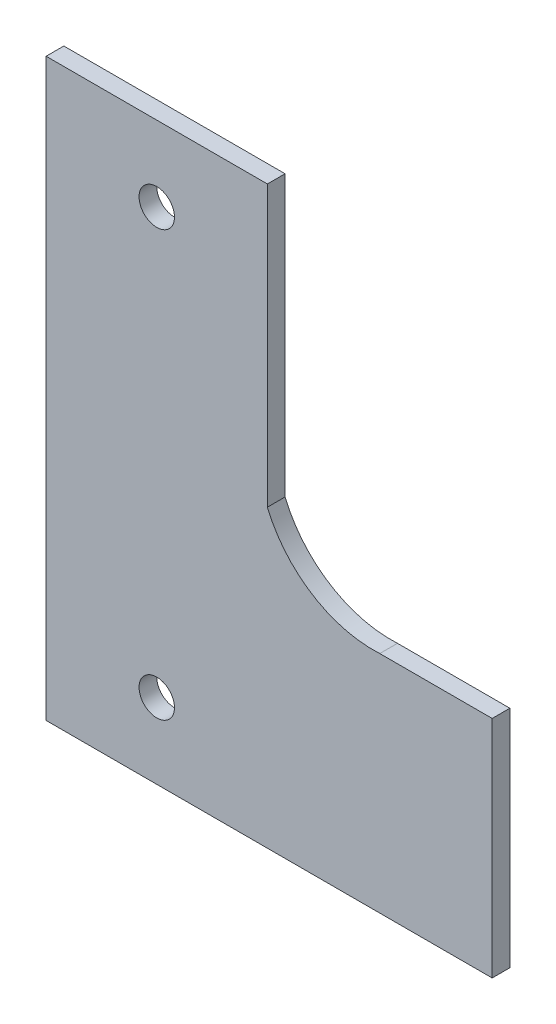
ISO-10303-21;
HEADER;
FILE_DESCRIPTION(('STEP AP214'),'2;1');
FILE_NAME('part.step','',(''),(''),'','','');
FILE_SCHEMA(('AUTOMOTIVE_DESIGN { 1 0 10303 214 1 1 1 1 }'));
ENDSEC;
DATA;
#1=APPLICATION_CONTEXT('core data for automotive mechanical design processes');
#2=APPLICATION_PROTOCOL_DEFINITION('international standard','automotive_design',2000,#1);
#3=PRODUCT_CONTEXT('',#1,'mechanical');
#4=PRODUCT('Part','Part','',(#3));
#5=PRODUCT_RELATED_PRODUCT_CATEGORY('part','',(#4));
#6=PRODUCT_DEFINITION_FORMATION('','',#4);
#7=PRODUCT_DEFINITION_CONTEXT('part definition',#1,'design');
#8=PRODUCT_DEFINITION('design','',#6,#7);
#9=PRODUCT_DEFINITION_SHAPE('','',#8);
#10=(LENGTH_UNIT() NAMED_UNIT(*) SI_UNIT(.MILLI.,.METRE.));
#11=(NAMED_UNIT(*) PLANE_ANGLE_UNIT() SI_UNIT($,.RADIAN.));
#12=(NAMED_UNIT(*) SI_UNIT($,.STERADIAN.) SOLID_ANGLE_UNIT());
#13=UNCERTAINTY_MEASURE_WITH_UNIT(LENGTH_MEASURE(1.E-05),#10,'distance_accuracy_value','');
#14=(GEOMETRIC_REPRESENTATION_CONTEXT(3) GLOBAL_UNCERTAINTY_ASSIGNED_CONTEXT((#13)) GLOBAL_UNIT_ASSIGNED_CONTEXT((#10,
#11,#12)) REPRESENTATION_CONTEXT('',''));
#15=CARTESIAN_POINT('',(0.,0.,0.));
#16=DIRECTION('',(0.,0.,1.));
#17=DIRECTION('',(1.,0.,0.));
#18=AXIS2_PLACEMENT_3D('',#15,#16,#17);
#19=CARTESIAN_POINT('',(0.,7.24006270311024,2.));
#20=DIRECTION('',(0.,1.,0.));
#21=DIRECTION('',(-1.,0.,0.));
#22=AXIS2_PLACEMENT_3D('',#19,#20,#21);
#23=PLANE('',#22);
#24=DIRECTION('',(1.,0.,0.));
#25=VECTOR('',#24,1.);
#26=CARTESIAN_POINT('',(0.,7.24006270311024,0.));
#27=LINE('',#26,#25);
#28=CARTESIAN_POINT('',(22.4630357452038,7.24006270311024,0.));
#29=VERTEX_POINT('',#28);
#30=CARTESIAN_POINT('',(35.1630357452038,7.24006270311024,0.));
#31=VERTEX_POINT('',#30);
#32=EDGE_CURVE('E130',#29,#31,#27,.T.);
#33=ORIENTED_EDGE('',*,*,#32,.F.);
#34=DIRECTION('',(0.,0.,-1.));
#35=VECTOR('',#34,1.);
#36=CARTESIAN_POINT('',(22.4630357452038,7.24006270311024,2.));
#37=LINE('',#36,#35);
#38=CARTESIAN_POINT('',(22.4630357452038,7.24006270311024,2.));
#39=VERTEX_POINT('',#38);
#40=EDGE_CURVE('E11',#39,#29,#37,.T.);
#41=ORIENTED_EDGE('',*,*,#40,.F.);
#42=DIRECTION('',(1.,0.,0.));
#43=VECTOR('',#42,1.);
#44=CARTESIAN_POINT('',(0.,7.24006270311024,2.));
#45=LINE('',#44,#43);
#46=CARTESIAN_POINT('',(35.1630357452038,7.24006270311024,2.));
#47=VERTEX_POINT('',#46);
#48=EDGE_CURVE('E153',#39,#47,#45,.T.);
#49=ORIENTED_EDGE('',*,*,#48,.T.);
#50=DIRECTION('',(0.,0.,-1.));
#51=VECTOR('',#50,1.);
#52=CARTESIAN_POINT('',(35.1630357452038,7.24006270311024,2.));
#53=LINE('',#52,#51);
#54=EDGE_CURVE('E51',#47,#31,#53,.T.);
#55=ORIENTED_EDGE('',*,*,#54,.T.);
#56=EDGE_LOOP('',(#33,#41,#49,#55));
#57=FACE_BOUND('',#56,.T.);
#58=ADVANCED_FACE('F35',(#57),#23,.T.);
#59=CARTESIAN_POINT('',(21.724237457013,20.1663444718695,2.));
#60=DIRECTION('',(0.,0.,-1.));
#61=DIRECTION('',(-1.,0.,0.));
#62=AXIS2_PLACEMENT_3D('',#59,#60,#61);
#63=CYLINDRICAL_SURFACE('',#62,12.9473774671164);
#64=CARTESIAN_POINT('',(21.724237457013,20.1663444718695,0.));
#65=DIRECTION('',(0.,0.,1.));
#66=DIRECTION('',(1.,0.,0.));
#67=AXIS2_PLACEMENT_3D('',#64,#65,#66);
#68=CIRCLE('',#67,12.9473774671164);
#69=CARTESIAN_POINT('',(9.76303574520384,15.2101123460097,0.));
#70=VERTEX_POINT('',#69);
#71=EDGE_CURVE('E132',#29,#70,#68,.F.);
#72=ORIENTED_EDGE('',*,*,#71,.T.);
#73=DIRECTION('',(0.,0.,-1.));
#74=VECTOR('',#73,1.);
#75=CARTESIAN_POINT('',(9.76303574520384,15.2101123460097,2.));
#76=LINE('',#75,#74);
#77=CARTESIAN_POINT('',(9.76303574520384,15.2101123460097,2.));
#78=VERTEX_POINT('',#77);
#79=EDGE_CURVE('E43',#78,#70,#76,.T.);
#80=ORIENTED_EDGE('',*,*,#79,.F.);
#81=CARTESIAN_POINT('',(21.724237457013,20.1663444718695,2.));
#82=DIRECTION('',(0.,0.,1.));
#83=DIRECTION('',(1.,0.,0.));
#84=AXIS2_PLACEMENT_3D('',#81,#82,#83);
#85=CIRCLE('',#84,12.9473774671164);
#86=EDGE_CURVE('E173',#39,#78,#85,.F.);
#87=ORIENTED_EDGE('',*,*,#86,.F.);
#88=ORIENTED_EDGE('',*,*,#40,.T.);
#89=EDGE_LOOP('',(#72,#80,#87,#88));
#90=FACE_BOUND('',#89,.T.);
#91=ADVANCED_FACE('F166',(#90),#63,.F.);
#92=CARTESIAN_POINT('',(9.76303574520384,0.,2.));
#93=DIRECTION('',(1.,0.,0.));
#94=DIRECTION('',(0.,1.,0.));
#95=AXIS2_PLACEMENT_3D('',#92,#93,#94);
#96=PLANE('',#95);
#97=DIRECTION('',(0.,-1.,0.));
#98=VECTOR('',#97,1.);
#99=CARTESIAN_POINT('',(9.76303574520384,0.,0.));
#100=LINE('',#99,#98);
#101=CARTESIAN_POINT('',(9.76303574520383,46.8400627031102,0.));
#102=VERTEX_POINT('',#101);
#103=EDGE_CURVE('E135',#102,#70,#100,.T.);
#104=ORIENTED_EDGE('',*,*,#103,.F.);
#105=DIRECTION('',(0.,0.,-1.));
#106=VECTOR('',#105,1.);
#107=CARTESIAN_POINT('',(9.76303574520383,46.8400627031102,2.));
#108=LINE('',#107,#106);
#109=CARTESIAN_POINT('',(9.76303574520383,46.8400627031102,2.));
#110=VERTEX_POINT('',#109);
#111=EDGE_CURVE('E157',#110,#102,#108,.T.);
#112=ORIENTED_EDGE('',*,*,#111,.F.);
#113=DIRECTION('',(0.,-1.,0.));
#114=VECTOR('',#113,1.);
#115=CARTESIAN_POINT('',(9.76303574520384,0.,2.));
#116=LINE('',#115,#114);
#117=EDGE_CURVE('E163',#110,#78,#116,.T.);
#118=ORIENTED_EDGE('',*,*,#117,.T.);
#119=ORIENTED_EDGE('',*,*,#79,.T.);
#120=EDGE_LOOP('',(#104,#112,#118,#119));
#121=FACE_BOUND('',#120,.T.);
#122=ADVANCED_FACE('F162',(#121),#96,.T.);
#123=CARTESIAN_POINT('',(0.,46.8400627031102,2.));
#124=DIRECTION('',(0.,1.,0.));
#125=DIRECTION('',(0.,0.,1.));
#126=AXIS2_PLACEMENT_3D('',#123,#124,#125);
#127=PLANE('',#126);
#128=DIRECTION('',(1.,0.,0.));
#129=VECTOR('',#128,1.);
#130=CARTESIAN_POINT('',(0.,46.8400627031102,0.));
#131=LINE('',#130,#129);
#132=CARTESIAN_POINT('',(-15.2369642547962,46.8400627031102,0.));
#133=VERTEX_POINT('',#132);
#134=EDGE_CURVE('E138',#133,#102,#131,.T.);
#135=ORIENTED_EDGE('',*,*,#134,.F.);
#136=DIRECTION('',(0.,0.,-1.));
#137=VECTOR('',#136,1.);
#138=CARTESIAN_POINT('',(-15.2369642547962,46.8400627031102,2.));
#139=LINE('',#138,#137);
#140=CARTESIAN_POINT('',(-15.2369642547962,46.8400627031102,2.));
#141=VERTEX_POINT('',#140);
#142=EDGE_CURVE('E104',#141,#133,#139,.T.);
#143=ORIENTED_EDGE('',*,*,#142,.F.);
#144=DIRECTION('',(1.,0.,0.));
#145=VECTOR('',#144,1.);
#146=CARTESIAN_POINT('',(0.,46.8400627031102,2.));
#147=LINE('',#146,#145);
#148=EDGE_CURVE('E116',#141,#110,#147,.T.);
#149=ORIENTED_EDGE('',*,*,#148,.T.);
#150=ORIENTED_EDGE('',*,*,#111,.T.);
#151=EDGE_LOOP('',(#135,#143,#149,#150));
#152=FACE_BOUND('',#151,.T.);
#153=ADVANCED_FACE('F172',(#152),#127,.T.);
#154=CARTESIAN_POINT('',(-15.2369642547962,0.,2.));
#155=DIRECTION('',(-1.,0.,0.));
#156=DIRECTION('',(0.,0.,1.));
#157=AXIS2_PLACEMENT_3D('',#154,#155,#156);
#158=PLANE('',#157);
#159=DIRECTION('',(0.,1.,0.));
#160=VECTOR('',#159,1.);
#161=CARTESIAN_POINT('',(-15.2369642547962,0.,0.));
#162=LINE('',#161,#160);
#163=CARTESIAN_POINT('',(-15.2369642547962,-18.1599372968898,0.));
#164=VERTEX_POINT('',#163);
#165=EDGE_CURVE('E100',#164,#133,#162,.T.);
#166=ORIENTED_EDGE('',*,*,#165,.F.);
#167=DIRECTION('',(0.,0.,-1.));
#168=VECTOR('',#167,1.);
#169=CARTESIAN_POINT('',(-15.2369642547962,-18.1599372968898,2.));
#170=LINE('',#169,#168);
#171=CARTESIAN_POINT('',(-15.2369642547962,-18.1599372968898,2.));
#172=VERTEX_POINT('',#171);
#173=EDGE_CURVE('E95',#172,#164,#170,.T.);
#174=ORIENTED_EDGE('',*,*,#173,.F.);
#175=DIRECTION('',(0.,1.,0.));
#176=VECTOR('',#175,1.);
#177=CARTESIAN_POINT('',(-15.2369642547962,0.,2.));
#178=LINE('',#177,#176);
#179=EDGE_CURVE('E98',#172,#141,#178,.T.);
#180=ORIENTED_EDGE('',*,*,#179,.T.);
#181=ORIENTED_EDGE('',*,*,#142,.T.);
#182=EDGE_LOOP('',(#166,#174,#180,#181));
#183=FACE_BOUND('',#182,.T.);
#184=ADVANCED_FACE('F97',(#183),#158,.T.);
#185=CARTESIAN_POINT('',(0.,-18.1599372968898,2.));
#186=DIRECTION('',(0.,-1.,0.));
#187=DIRECTION('',(1.,0.,0.));
#188=AXIS2_PLACEMENT_3D('',#185,#186,#187);
#189=PLANE('',#188);
#190=DIRECTION('',(-1.,0.,0.));
#191=VECTOR('',#190,1.);
#192=CARTESIAN_POINT('',(0.,-18.1599372968898,0.));
#193=LINE('',#192,#191);
#194=CARTESIAN_POINT('',(35.1630357452038,-18.1599372968898,0.));
#195=VERTEX_POINT('',#194);
#196=EDGE_CURVE('E142',#195,#164,#193,.T.);
#197=ORIENTED_EDGE('',*,*,#196,.F.);
#198=DIRECTION('',(0.,0.,-1.));
#199=VECTOR('',#198,1.);
#200=CARTESIAN_POINT('',(35.1630357452038,-18.1599372968898,2.));
#201=LINE('',#200,#199);
#202=CARTESIAN_POINT('',(35.1630357452038,-18.1599372968898,2.));
#203=VERTEX_POINT('',#202);
#204=EDGE_CURVE('E73',#203,#195,#201,.T.);
#205=ORIENTED_EDGE('',*,*,#204,.F.);
#206=DIRECTION('',(-1.,0.,0.));
#207=VECTOR('',#206,1.);
#208=CARTESIAN_POINT('',(0.,-18.1599372968898,2.));
#209=LINE('',#208,#207);
#210=EDGE_CURVE('E113',#203,#172,#209,.T.);
#211=ORIENTED_EDGE('',*,*,#210,.T.);
#212=ORIENTED_EDGE('',*,*,#173,.T.);
#213=EDGE_LOOP('',(#197,#205,#211,#212));
#214=FACE_BOUND('',#213,.T.);
#215=ADVANCED_FACE('F118',(#214),#189,.T.);
#216=CARTESIAN_POINT('',(-2.73696425479615,-9.65993729688976,2.));
#217=DIRECTION('',(0.,0.,-1.));
#218=DIRECTION('',(-1.,0.,0.));
#219=AXIS2_PLACEMENT_3D('',#216,#217,#218);
#220=CYLINDRICAL_SURFACE('',#219,2.);
#221=CARTESIAN_POINT('',(-2.73696425479615,-9.65993729688976,2.));
#222=DIRECTION('',(0.,0.,1.));
#223=DIRECTION('',(1.,0.,0.));
#224=AXIS2_PLACEMENT_3D('',#221,#222,#223);
#225=CIRCLE('',#224,2.);
#226=CARTESIAN_POINT('',(-0.736964254796149,-9.65993729688976,2.));
#227=VERTEX_POINT('',#226);
#228=EDGE_CURVE('E121',#227,#227,#225,.T.);
#229=ORIENTED_EDGE('',*,*,#228,.T.);
#230=EDGE_LOOP('',(#229));
#231=FACE_BOUND('',#230,.T.);
#232=CARTESIAN_POINT('',(-2.73696425479615,-9.65993729688976,0.));
#233=DIRECTION('',(0.,0.,1.));
#234=DIRECTION('',(1.,0.,0.));
#235=AXIS2_PLACEMENT_3D('',#232,#233,#234);
#236=CIRCLE('',#235,2.);
#237=CARTESIAN_POINT('',(-0.736964254796149,-9.65993729688976,0.));
#238=VERTEX_POINT('',#237);
#239=EDGE_CURVE('E147',#238,#238,#236,.T.);
#240=ORIENTED_EDGE('',*,*,#239,.F.);
#241=EDGE_LOOP('',(#240));
#242=FACE_BOUND('',#241,.T.);
#243=ADVANCED_FACE('F180',(#231,#242),#220,.F.);
#244=CARTESIAN_POINT('',(35.1630357452038,0.,2.));
#245=DIRECTION('',(1.,0.,0.));
#246=DIRECTION('',(0.,1.,0.));
#247=AXIS2_PLACEMENT_3D('',#244,#245,#246);
#248=PLANE('',#247);
#249=DIRECTION('',(0.,-1.,0.));
#250=VECTOR('',#249,1.);
#251=CARTESIAN_POINT('',(35.1630357452038,0.,0.));
#252=LINE('',#251,#250);
#253=EDGE_CURVE('E144',#31,#195,#252,.T.);
#254=ORIENTED_EDGE('',*,*,#253,.F.);
#255=ORIENTED_EDGE('',*,*,#54,.F.);
#256=DIRECTION('',(0.,-1.,0.));
#257=VECTOR('',#256,1.);
#258=CARTESIAN_POINT('',(35.1630357452038,0.,2.));
#259=LINE('',#258,#257);
#260=EDGE_CURVE('E119',#47,#203,#259,.T.);
#261=ORIENTED_EDGE('',*,*,#260,.T.);
#262=ORIENTED_EDGE('',*,*,#204,.T.);
#263=EDGE_LOOP('',(#254,#255,#261,#262));
#264=FACE_BOUND('',#263,.T.);
#265=ADVANCED_FACE('F177',(#264),#248,.T.);
#266=CARTESIAN_POINT('',(-2.73696425479615,38.3400627031102,2.));
#267=DIRECTION('',(0.,0.,-1.));
#268=DIRECTION('',(-1.,0.,0.));
#269=AXIS2_PLACEMENT_3D('',#266,#267,#268);
#270=CYLINDRICAL_SURFACE('',#269,2.);
#271=CARTESIAN_POINT('',(-2.73696425479615,38.3400627031102,2.));
#272=DIRECTION('',(0.,0.,1.));
#273=DIRECTION('',(1.,0.,0.));
#274=AXIS2_PLACEMENT_3D('',#271,#272,#273);
#275=CIRCLE('',#274,2.);
#276=CARTESIAN_POINT('',(-0.73696425479615,38.3400627031102,2.));
#277=VERTEX_POINT('',#276);
#278=EDGE_CURVE('E127',#277,#277,#275,.T.);
#279=ORIENTED_EDGE('',*,*,#278,.T.);
#280=EDGE_LOOP('',(#279));
#281=FACE_BOUND('',#280,.T.);
#282=CARTESIAN_POINT('',(-2.73696425479615,38.3400627031102,0.));
#283=DIRECTION('',(0.,0.,1.));
#284=DIRECTION('',(1.,0.,0.));
#285=AXIS2_PLACEMENT_3D('',#282,#283,#284);
#286=CIRCLE('',#285,2.);
#287=CARTESIAN_POINT('',(-0.73696425479615,38.3400627031102,0.));
#288=VERTEX_POINT('',#287);
#289=EDGE_CURVE('E150',#288,#288,#286,.T.);
#290=ORIENTED_EDGE('',*,*,#289,.F.);
#291=EDGE_LOOP('',(#290));
#292=FACE_BOUND('',#291,.T.);
#293=ADVANCED_FACE('F179',(#281,#292),#270,.F.);
#294=CARTESIAN_POINT('',(0.,0.,2.));
#295=DIRECTION('',(0.,0.,1.));
#296=DIRECTION('',(1.,0.,0.));
#297=AXIS2_PLACEMENT_3D('',#294,#295,#296);
#298=PLANE('',#297);
#299=ORIENTED_EDGE('',*,*,#48,.F.);
#300=ORIENTED_EDGE('',*,*,#86,.T.);
#301=ORIENTED_EDGE('',*,*,#117,.F.);
#302=ORIENTED_EDGE('',*,*,#148,.F.);
#303=ORIENTED_EDGE('',*,*,#179,.F.);
#304=ORIENTED_EDGE('',*,*,#210,.F.);
#305=ORIENTED_EDGE('',*,*,#260,.F.);
#306=EDGE_LOOP('',(#299,#300,#301,#302,#303,#304,#305));
#307=FACE_BOUND('',#306,.T.);
#308=ORIENTED_EDGE('',*,*,#228,.F.);
#309=EDGE_LOOP('',(#308));
#310=FACE_BOUND('',#309,.T.);
#311=ORIENTED_EDGE('',*,*,#278,.F.);
#312=EDGE_LOOP('',(#311));
#313=FACE_BOUND('',#312,.T.);
#314=ADVANCED_FACE('F110',(#307,#310,#313),#298,.T.);
#315=CARTESIAN_POINT('',(0.,0.,0.));
#316=DIRECTION('',(0.,0.,1.));
#317=DIRECTION('',(1.,0.,0.));
#318=AXIS2_PLACEMENT_3D('',#315,#316,#317);
#319=PLANE('',#318);
#320=ORIENTED_EDGE('',*,*,#32,.T.);
#321=ORIENTED_EDGE('',*,*,#253,.T.);
#322=ORIENTED_EDGE('',*,*,#196,.T.);
#323=ORIENTED_EDGE('',*,*,#165,.T.);
#324=ORIENTED_EDGE('',*,*,#134,.T.);
#325=ORIENTED_EDGE('',*,*,#103,.T.);
#326=ORIENTED_EDGE('',*,*,#71,.F.);
#327=EDGE_LOOP('',(#320,#321,#322,#323,#324,#325,#326));
#328=FACE_BOUND('',#327,.T.);
#329=ORIENTED_EDGE('',*,*,#239,.T.);
#330=EDGE_LOOP('',(#329));
#331=FACE_BOUND('',#330,.T.);
#332=ORIENTED_EDGE('',*,*,#289,.T.);
#333=EDGE_LOOP('',(#332));
#334=FACE_BOUND('',#333,.T.);
#335=ADVANCED_FACE('F168',(#328,#331,#334),#319,.F.);
#336=CLOSED_SHELL('',(#58,#91,#122,#153,#184,#215,#243,#265,#293,#314,#335));
#337=MANIFOLD_SOLID_BREP('B2',#336);
#338=ADVANCED_BREP_SHAPE_REPRESENTATION('',(#18,#337),#14);
#339=SHAPE_DEFINITION_REPRESENTATION(#9,#338);
ENDSEC;
END-ISO-10303-21;
